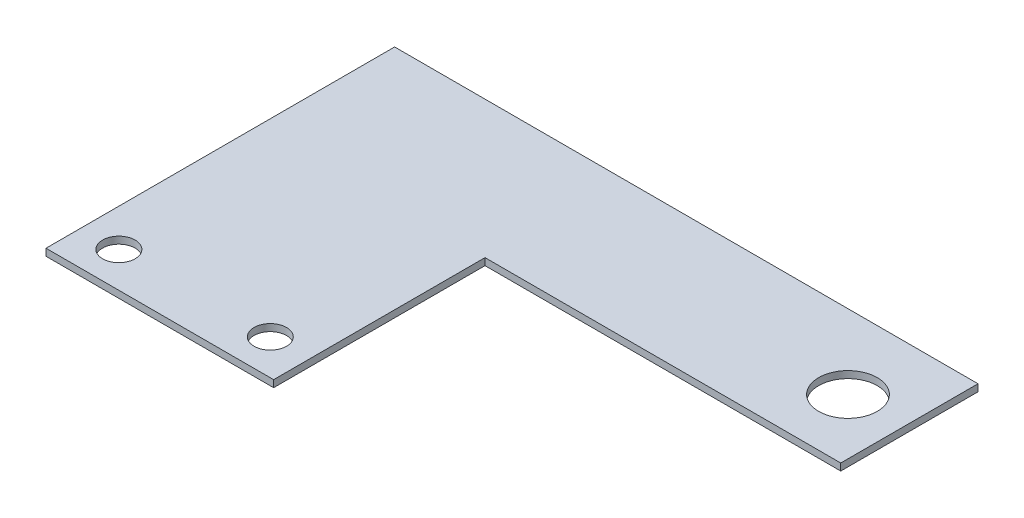
ISO-10303-21;
HEADER;
FILE_DESCRIPTION(('STEP AP214'),'2;1');
FILE_NAME('part.step','',(''),(''),'','','');
FILE_SCHEMA(('AUTOMOTIVE_DESIGN { 1 0 10303 214 1 1 1 1 }'));
ENDSEC;
DATA;
#1=APPLICATION_CONTEXT('core data for automotive mechanical design processes');
#2=APPLICATION_PROTOCOL_DEFINITION('international standard','automotive_design',2000,#1);
#3=PRODUCT_CONTEXT('',#1,'mechanical');
#4=PRODUCT('Part','Part','',(#3));
#5=PRODUCT_RELATED_PRODUCT_CATEGORY('part','',(#4));
#6=PRODUCT_DEFINITION_FORMATION('','',#4);
#7=PRODUCT_DEFINITION_CONTEXT('part definition',#1,'design');
#8=PRODUCT_DEFINITION('design','',#6,#7);
#9=PRODUCT_DEFINITION_SHAPE('','',#8);
#10=(LENGTH_UNIT() NAMED_UNIT(*) SI_UNIT(.MILLI.,.METRE.));
#11=(NAMED_UNIT(*) PLANE_ANGLE_UNIT() SI_UNIT($,.RADIAN.));
#12=(NAMED_UNIT(*) SI_UNIT($,.STERADIAN.) SOLID_ANGLE_UNIT());
#13=UNCERTAINTY_MEASURE_WITH_UNIT(LENGTH_MEASURE(1.E-05),#10,'distance_accuracy_value','');
#14=(GEOMETRIC_REPRESENTATION_CONTEXT(3) GLOBAL_UNCERTAINTY_ASSIGNED_CONTEXT((#13)) GLOBAL_UNIT_ASSIGNED_CONTEXT((#10,
#11,#12)) REPRESENTATION_CONTEXT('',''));
#15=CARTESIAN_POINT('',(0.,0.,0.));
#16=DIRECTION('',(0.,0.,1.));
#17=DIRECTION('',(1.,0.,0.));
#18=AXIS2_PLACEMENT_3D('',#15,#16,#17);
#19=CARTESIAN_POINT('',(68.0727371083289,-1.0160000000002,-50.6468131083289));
#20=DIRECTION('',(0.,0.,1.));
#21=DIRECTION('',(0.,-1.,0.));
#22=AXIS2_PLACEMENT_3D('',#19,#20,#21);
#23=PLANE('',#22);
#24=DIRECTION('',(-1.,0.,0.));
#25=VECTOR('',#24,1.);
#26=CARTESIAN_POINT('',(68.072737108329,-1.92554305833426E-13,-50.6468131083289));
#27=LINE('',#26,#25);
#28=CARTESIAN_POINT('',(0.,-2.63677968348475E-13,-50.6468131083289));
#29=VERTEX_POINT('',#28);
#30=CARTESIAN_POINT('',(84.7470502166579,-2.0643209364124E-13,-50.6468131083289));
#31=VERTEX_POINT('',#30);
#32=EDGE_CURVE('E111',#29,#31,#27,.F.);
#33=ORIENTED_EDGE('',*,*,#32,.T.);
#34=DIRECTION('',(0.,-1.,0.));
#35=VECTOR('',#34,1.);
#36=CARTESIAN_POINT('',(84.7470502166579,-2.0643209364124E-13,-50.6468131083289));
#37=LINE('',#36,#35);
#38=CARTESIAN_POINT('',(84.7470502166579,-1.01600000000021,-50.6468131083289));
#39=VERTEX_POINT('',#38);
#40=EDGE_CURVE('E219',#31,#39,#37,.T.);
#41=ORIENTED_EDGE('',*,*,#40,.T.);
#42=DIRECTION('',(1.,0.,0.));
#43=VECTOR('',#42,1.);
#44=CARTESIAN_POINT('',(69.5748931083287,-1.01600000000021,-50.6468131083289));
#45=LINE('',#44,#43);
#46=CARTESIAN_POINT('',(0.,-1.01600000000026,-50.6468131083289));
#47=VERTEX_POINT('',#46);
#48=EDGE_CURVE('E117',#47,#39,#45,.T.);
#49=ORIENTED_EDGE('',*,*,#48,.F.);
#50=DIRECTION('',(0.,1.,0.));
#51=VECTOR('',#50,1.);
#52=CARTESIAN_POINT('',(0.,-1.01600000000026,-50.6468131083289));
#53=LINE('',#52,#51);
#54=EDGE_CURVE('E210',#47,#29,#53,.T.);
#55=ORIENTED_EDGE('',*,*,#54,.T.);
#56=EDGE_LOOP('',(#33,#41,#49,#55));
#57=FACE_BOUND('',#56,.T.);
#58=ADVANCED_FACE('F107',(#57),#23,.F.);
#59=CARTESIAN_POINT('',(56.4938931083289,-1.01600000000005,-30.7078131083289));
#60=DIRECTION('',(0.,0.,-1.));
#61=DIRECTION('',(0.,1.,0.));
#62=AXIS2_PLACEMENT_3D('',#59,#60,#61);
#63=PLANE('',#62);
#64=DIRECTION('',(-1.,0.,0.));
#65=VECTOR('',#64,1.);
#66=CARTESIAN_POINT('',(69.5748931083287,-1.01600000000015,-30.7078131083289));
#67=LINE('',#66,#65);
#68=CARTESIAN_POINT('',(84.7470502166579,-1.01600000000014,-30.7078131083289));
#69=VERTEX_POINT('',#68);
#70=CARTESIAN_POINT('',(33.06826,-1.01600000000012,-30.7078131083289));
#71=VERTEX_POINT('',#70);
#72=EDGE_CURVE('E13',#69,#71,#67,.T.);
#73=ORIENTED_EDGE('',*,*,#72,.F.);
#74=DIRECTION('',(0.,-1.,0.));
#75=VECTOR('',#74,1.);
#76=CARTESIAN_POINT('',(84.7470502166579,-1.37043154602168E-13,-30.7078131083289));
#77=LINE('',#76,#75);
#78=CARTESIAN_POINT('',(84.7470502166579,-1.37043154602168E-13,-30.7078131083289));
#79=VERTEX_POINT('',#78);
#80=EDGE_CURVE('E227',#79,#69,#77,.T.);
#81=ORIENTED_EDGE('',*,*,#80,.F.);
#82=DIRECTION('',(1.,0.,0.));
#83=VECTOR('',#82,1.);
#84=CARTESIAN_POINT('',(56.4938931083289,0.,-30.7078131083289));
#85=LINE('',#84,#83);
#86=CARTESIAN_POINT('',(33.06826,-1.2490009027033E-13,-30.7078131083289));
#87=VERTEX_POINT('',#86);
#88=EDGE_CURVE('E137',#79,#87,#85,.F.);
#89=ORIENTED_EDGE('',*,*,#88,.T.);
#90=DIRECTION('',(0.,1.,0.));
#91=VECTOR('',#90,1.);
#92=CARTESIAN_POINT('',(33.06826,-1.01600000000006,-30.7078131083289));
#93=LINE('',#92,#91);
#94=EDGE_CURVE('E182',#71,#87,#93,.T.);
#95=ORIENTED_EDGE('',*,*,#94,.F.);
#96=EDGE_LOOP('',(#73,#81,#89,#95));
#97=FACE_BOUND('',#96,.T.);
#98=ADVANCED_FACE('F237',(#97),#63,.F.);
#99=CARTESIAN_POINT('',(69.5748931083287,-1.01600000000009,-13.5628131083289));
#100=DIRECTION('',(0.,1.,0.));
#101=DIRECTION('',(1.,0.,0.));
#102=AXIS2_PLACEMENT_3D('',#99,#100,#101);
#103=PLANE('',#102);
#104=ORIENTED_EDGE('',*,*,#48,.T.);
#105=DIRECTION('',(0.,0.,1.));
#106=VECTOR('',#105,1.);
#107=CARTESIAN_POINT('',(84.7470502166579,-1.01600000000021,-50.6468131083289));
#108=LINE('',#107,#106);
#109=EDGE_CURVE('E212',#69,#39,#108,.F.);
#110=ORIENTED_EDGE('',*,*,#109,.F.);
#111=ORIENTED_EDGE('',*,*,#72,.T.);
#112=DIRECTION('',(0.,0.,1.));
#113=VECTOR('',#112,1.);
#114=CARTESIAN_POINT('',(33.06826,-1.016,-13.5628131083289));
#115=LINE('',#114,#113);
#116=CARTESIAN_POINT('',(33.06826,-1.016,0.));
#117=VERTEX_POINT('',#116);
#118=EDGE_CURVE('E172',#71,#117,#115,.T.);
#119=ORIENTED_EDGE('',*,*,#118,.T.);
#120=DIRECTION('',(1.,0.,0.));
#121=VECTOR('',#120,1.);
#122=CARTESIAN_POINT('',(0.,-1.016,0.));
#123=LINE('',#122,#121);
#124=CARTESIAN_POINT('',(0.,-1.016,0.));
#125=VERTEX_POINT('',#124);
#126=EDGE_CURVE('E189',#125,#117,#123,.T.);
#127=ORIENTED_EDGE('',*,*,#126,.F.);
#128=DIRECTION('',(0.,0.,-1.));
#129=VECTOR('',#128,1.);
#130=CARTESIAN_POINT('',(0.,-1.016,-13.5628131083289));
#131=LINE('',#130,#129);
#132=EDGE_CURVE('E167',#125,#47,#131,.T.);
#133=ORIENTED_EDGE('',*,*,#132,.T.);
#134=EDGE_LOOP('',(#104,#110,#111,#119,#127,#133));
#135=FACE_BOUND('',#134,.T.);
#136=CARTESIAN_POINT('',(76.6526302166566,-1.01600000000017,-39.8517433325187));
#137=DIRECTION('',(0.,-1.,0.));
#138=DIRECTION('',(-1.,0.,0.));
#139=AXIS2_PLACEMENT_3D('',#136,#137,#138);
#140=CIRCLE('',#139,4.25449999999999);
#141=CARTESIAN_POINT('',(72.3981302166566,-1.01600000000017,-39.8517433325187));
#142=VERTEX_POINT('',#141);
#143=EDGE_CURVE('E221',#142,#142,#140,.F.);
#144=ORIENTED_EDGE('',*,*,#143,.T.);
#145=EDGE_LOOP('',(#144));
#146=FACE_BOUND('',#145,.T.);
#147=CARTESIAN_POINT('',(27.4421600000001,-1.016,-5.14350000000011));
#148=DIRECTION('',(0.,-1.,0.));
#149=DIRECTION('',(0.,0.,-1.));
#150=AXIS2_PLACEMENT_3D('',#147,#148,#149);
#151=CIRCLE('',#150,2.36295847969978);
#152=CARTESIAN_POINT('',(27.4421600000001,-1.016,-7.50645847969989));
#153=VERTEX_POINT('',#152);
#154=EDGE_CURVE('E199',#153,#153,#151,.F.);
#155=ORIENTED_EDGE('',*,*,#154,.T.);
#156=EDGE_LOOP('',(#155));
#157=FACE_BOUND('',#156,.T.);
#158=CARTESIAN_POINT('',(5.44215999999997,-1.016,-5.1435));
#159=DIRECTION('',(0.,-1.,0.));
#160=DIRECTION('',(0.,0.,-1.));
#161=AXIS2_PLACEMENT_3D('',#158,#159,#160);
#162=CIRCLE('',#161,2.36295847969991);
#163=CARTESIAN_POINT('',(5.44215999999997,-1.016,-7.5064584796999));
#164=VERTEX_POINT('',#163);
#165=EDGE_CURVE('E195',#164,#164,#162,.F.);
#166=ORIENTED_EDGE('',*,*,#165,.T.);
#167=EDGE_LOOP('',(#166));
#168=FACE_BOUND('',#167,.T.);
#169=ADVANCED_FACE('F234',(#135,#146,#157,#168),#103,.F.);
#170=CARTESIAN_POINT('',(0.,0.,0.));
#171=DIRECTION('',(0.,-1.,0.));
#172=DIRECTION('',(0.,0.,-1.));
#173=AXIS2_PLACEMENT_3D('',#170,#171,#172);
#174=PLANE('',#173);
#175=ORIENTED_EDGE('',*,*,#88,.F.);
#176=DIRECTION('',(0.,0.,-1.));
#177=VECTOR('',#176,1.);
#178=CARTESIAN_POINT('',(84.7470502166579,0.,-13.5628131083289));
#179=LINE('',#178,#177);
#180=EDGE_CURVE('E217',#79,#31,#179,.T.);
#181=ORIENTED_EDGE('',*,*,#180,.T.);
#182=ORIENTED_EDGE('',*,*,#32,.F.);
#183=DIRECTION('',(0.,0.,1.));
#184=VECTOR('',#183,1.);
#185=CARTESIAN_POINT('',(0.,-2.63677968348475E-13,-50.6468131083289));
#186=LINE('',#185,#184);
#187=CARTESIAN_POINT('',(0.,0.,0.));
#188=VERTEX_POINT('',#187);
#189=EDGE_CURVE('E193',#188,#29,#186,.F.);
#190=ORIENTED_EDGE('',*,*,#189,.F.);
#191=DIRECTION('',(1.,0.,0.));
#192=VECTOR('',#191,1.);
#193=CARTESIAN_POINT('',(0.,0.,0.));
#194=LINE('',#193,#192);
#195=CARTESIAN_POINT('',(33.06826,0.,0.));
#196=VERTEX_POINT('',#195);
#197=EDGE_CURVE('E188',#188,#196,#194,.T.);
#198=ORIENTED_EDGE('',*,*,#197,.T.);
#199=DIRECTION('',(0.,0.,-1.));
#200=VECTOR('',#199,1.);
#201=CARTESIAN_POINT('',(33.06826,0.,-13.5628131083289));
#202=LINE('',#201,#200);
#203=EDGE_CURVE('E177',#87,#196,#202,.F.);
#204=ORIENTED_EDGE('',*,*,#203,.F.);
#205=EDGE_LOOP('',(#175,#181,#182,#190,#198,#204));
#206=FACE_BOUND('',#205,.T.);
#207=CARTESIAN_POINT('',(76.6526302166566,-1.61329283265843E-13,-39.8517433325187));
#208=DIRECTION('',(0.,1.,0.));
#209=DIRECTION('',(1.,0.,0.));
#210=AXIS2_PLACEMENT_3D('',#207,#208,#209);
#211=CIRCLE('',#210,4.25449999999999);
#212=CARTESIAN_POINT('',(80.9071302166566,-1.61329283265843E-13,-39.8517433325187));
#213=VERTEX_POINT('',#212);
#214=EDGE_CURVE('E224',#213,#213,#211,.T.);
#215=ORIENTED_EDGE('',*,*,#214,.F.);
#216=EDGE_LOOP('',(#215));
#217=FACE_BOUND('',#216,.T.);
#218=CARTESIAN_POINT('',(27.4421600000001,0.,-5.14350000000011));
#219=DIRECTION('',(0.,1.,0.));
#220=DIRECTION('',(0.,0.,1.));
#221=AXIS2_PLACEMENT_3D('',#218,#219,#220);
#222=CIRCLE('',#221,2.36295847969978);
#223=CARTESIAN_POINT('',(27.4421600000001,0.,-2.78054152030033));
#224=VERTEX_POINT('',#223);
#225=EDGE_CURVE('E204',#224,#224,#222,.T.);
#226=ORIENTED_EDGE('',*,*,#225,.F.);
#227=EDGE_LOOP('',(#226));
#228=FACE_BOUND('',#227,.T.);
#229=CARTESIAN_POINT('',(5.44215999999997,0.,-5.1435));
#230=DIRECTION('',(0.,1.,0.));
#231=DIRECTION('',(0.,0.,1.));
#232=AXIS2_PLACEMENT_3D('',#229,#230,#231);
#233=CIRCLE('',#232,2.36295847969991);
#234=CARTESIAN_POINT('',(5.44215999999997,0.,-2.78054152030009));
#235=VERTEX_POINT('',#234);
#236=EDGE_CURVE('E190',#235,#235,#233,.T.);
#237=ORIENTED_EDGE('',*,*,#236,.F.);
#238=EDGE_LOOP('',(#237));
#239=FACE_BOUND('',#238,.T.);
#240=ADVANCED_FACE('F109',(#206,#217,#228,#239),#174,.F.);
#241=CARTESIAN_POINT('',(84.7470502166579,-2.0643209364124E-13,-50.6468131083289));
#242=DIRECTION('',(-1.,0.,0.));
#243=DIRECTION('',(0.,1.,0.));
#244=AXIS2_PLACEMENT_3D('',#241,#242,#243);
#245=PLANE('',#244);
#246=ORIENTED_EDGE('',*,*,#109,.T.);
#247=ORIENTED_EDGE('',*,*,#40,.F.);
#248=ORIENTED_EDGE('',*,*,#180,.F.);
#249=ORIENTED_EDGE('',*,*,#80,.T.);
#250=EDGE_LOOP('',(#246,#247,#248,#249));
#251=FACE_BOUND('',#250,.T.);
#252=ADVANCED_FACE('F233',(#251),#245,.F.);
#253=CARTESIAN_POINT('',(76.6526302166566,-12.5958440000003,-39.8517433325186));
#254=DIRECTION('',(0.,1.,0.));
#255=DIRECTION('',(1.,0.,0.));
#256=AXIS2_PLACEMENT_3D('',#253,#254,#255);
#257=CYLINDRICAL_SURFACE('',#256,4.25449999999999);
#258=ORIENTED_EDGE('',*,*,#143,.F.);
#259=EDGE_LOOP('',(#258));
#260=FACE_BOUND('',#259,.T.);
#261=ORIENTED_EDGE('',*,*,#214,.T.);
#262=EDGE_LOOP('',(#261));
#263=FACE_BOUND('',#262,.T.);
#264=ADVANCED_FACE('F257',(#260,#263),#257,.F.);
#265=CARTESIAN_POINT('',(0.,-1.01600000000026,-50.6468131083289));
#266=DIRECTION('',(1.,0.,0.));
#267=DIRECTION('',(0.,-1.,0.));
#268=AXIS2_PLACEMENT_3D('',#265,#266,#267);
#269=PLANE('',#268);
#270=ORIENTED_EDGE('',*,*,#132,.F.);
#271=DIRECTION('',(0.,1.,0.));
#272=VECTOR('',#271,1.);
#273=CARTESIAN_POINT('',(0.,-1.016,0.));
#274=LINE('',#273,#272);
#275=EDGE_CURVE('E194',#125,#188,#274,.T.);
#276=ORIENTED_EDGE('',*,*,#275,.T.);
#277=ORIENTED_EDGE('',*,*,#189,.T.);
#278=ORIENTED_EDGE('',*,*,#54,.F.);
#279=EDGE_LOOP('',(#270,#276,#277,#278));
#280=FACE_BOUND('',#279,.T.);
#281=ADVANCED_FACE('F267',(#280),#269,.F.);
#282=CARTESIAN_POINT('',(33.06826,-1.016,-13.5628131083289));
#283=DIRECTION('',(-1.,0.,0.));
#284=DIRECTION('',(0.,1.,0.));
#285=AXIS2_PLACEMENT_3D('',#282,#283,#284);
#286=PLANE('',#285);
#287=ORIENTED_EDGE('',*,*,#118,.F.);
#288=ORIENTED_EDGE('',*,*,#94,.T.);
#289=ORIENTED_EDGE('',*,*,#203,.T.);
#290=DIRECTION('',(0.,1.,0.));
#291=VECTOR('',#290,1.);
#292=CARTESIAN_POINT('',(33.06826,-1.016,0.));
#293=LINE('',#292,#291);
#294=EDGE_CURVE('E180',#117,#196,#293,.T.);
#295=ORIENTED_EDGE('',*,*,#294,.F.);
#296=EDGE_LOOP('',(#287,#288,#289,#295));
#297=FACE_BOUND('',#296,.T.);
#298=ADVANCED_FACE('F179',(#297),#286,.F.);
#299=CARTESIAN_POINT('',(0.,-1.016,0.));
#300=DIRECTION('',(0.,0.,1.));
#301=DIRECTION('',(1.,0.,0.));
#302=AXIS2_PLACEMENT_3D('',#299,#300,#301);
#303=PLANE('',#302);
#304=ORIENTED_EDGE('',*,*,#197,.F.);
#305=ORIENTED_EDGE('',*,*,#275,.F.);
#306=ORIENTED_EDGE('',*,*,#126,.T.);
#307=ORIENTED_EDGE('',*,*,#294,.T.);
#308=EDGE_LOOP('',(#304,#305,#306,#307));
#309=FACE_BOUND('',#308,.T.);
#310=ADVANCED_FACE('F187',(#309),#303,.T.);
#311=CARTESIAN_POINT('',(5.44215999999997,-1.01700000000001,-5.1435));
#312=DIRECTION('',(0.,1.,0.));
#313=DIRECTION('',(0.,0.,1.));
#314=AXIS2_PLACEMENT_3D('',#311,#312,#313);
#315=CYLINDRICAL_SURFACE('',#314,2.36295847969991);
#316=ORIENTED_EDGE('',*,*,#165,.F.);
#317=EDGE_LOOP('',(#316));
#318=FACE_BOUND('',#317,.T.);
#319=ORIENTED_EDGE('',*,*,#236,.T.);
#320=EDGE_LOOP('',(#319));
#321=FACE_BOUND('',#320,.T.);
#322=ADVANCED_FACE('F245',(#318,#321),#315,.F.);
#323=CARTESIAN_POINT('',(27.4421600000001,-1.01700000000001,-5.14350000000011));
#324=DIRECTION('',(0.,1.,0.));
#325=DIRECTION('',(0.,0.,1.));
#326=AXIS2_PLACEMENT_3D('',#323,#324,#325);
#327=CYLINDRICAL_SURFACE('',#326,2.36295847969978);
#328=ORIENTED_EDGE('',*,*,#154,.F.);
#329=EDGE_LOOP('',(#328));
#330=FACE_BOUND('',#329,.T.);
#331=ORIENTED_EDGE('',*,*,#225,.T.);
#332=EDGE_LOOP('',(#331));
#333=FACE_BOUND('',#332,.T.);
#334=ADVANCED_FACE('F248',(#330,#333),#327,.F.);
#335=CLOSED_SHELL('',(#58,#98,#169,#240,#252,#264,#281,#298,#310,#322,#334));
#336=MANIFOLD_SOLID_BREP('B2',#335);
#337=ADVANCED_BREP_SHAPE_REPRESENTATION('',(#18,#336),#14);
#338=SHAPE_DEFINITION_REPRESENTATION(#9,#337);
ENDSEC;
END-ISO-10303-21;
